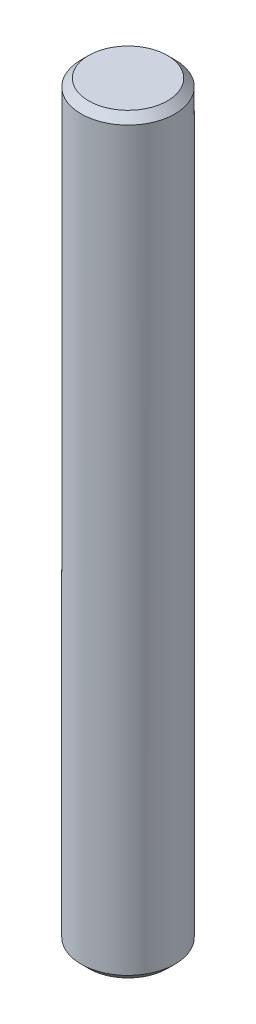
ISO-10303-21;
HEADER;
FILE_DESCRIPTION(('STEP AP214'),'2;1');
FILE_NAME('part.step','',(''),(''),'','','');
FILE_SCHEMA(('AUTOMOTIVE_DESIGN { 1 0 10303 214 1 1 1 1 }'));
ENDSEC;
DATA;
#1=APPLICATION_CONTEXT('core data for automotive mechanical design processes');
#2=APPLICATION_PROTOCOL_DEFINITION('international standard','automotive_design',2000,#1);
#3=PRODUCT_CONTEXT('',#1,'mechanical');
#4=PRODUCT('Part','Part','',(#3));
#5=PRODUCT_RELATED_PRODUCT_CATEGORY('part','',(#4));
#6=PRODUCT_DEFINITION_FORMATION('','',#4);
#7=PRODUCT_DEFINITION_CONTEXT('part definition',#1,'design');
#8=PRODUCT_DEFINITION('design','',#6,#7);
#9=PRODUCT_DEFINITION_SHAPE('','',#8);
#10=(LENGTH_UNIT() NAMED_UNIT(*) SI_UNIT(.MILLI.,.METRE.));
#11=(NAMED_UNIT(*) PLANE_ANGLE_UNIT() SI_UNIT($,.RADIAN.));
#12=(NAMED_UNIT(*) SI_UNIT($,.STERADIAN.) SOLID_ANGLE_UNIT());
#13=UNCERTAINTY_MEASURE_WITH_UNIT(LENGTH_MEASURE(1.E-05),#10,'distance_accuracy_value','');
#14=(GEOMETRIC_REPRESENTATION_CONTEXT(3) GLOBAL_UNCERTAINTY_ASSIGNED_CONTEXT((#13)) GLOBAL_UNIT_ASSIGNED_CONTEXT((#10,
#11,#12)) REPRESENTATION_CONTEXT('',''));
#15=CARTESIAN_POINT('',(0.,0.,0.));
#16=DIRECTION('',(0.,0.,1.));
#17=DIRECTION('',(1.,0.,0.));
#18=AXIS2_PLACEMENT_3D('',#15,#16,#17);
#19=CARTESIAN_POINT('',(0.,50.8,0.));
#20=DIRECTION('',(0.,-1.,0.));
#21=DIRECTION('',(0.,0.,-1.));
#22=AXIS2_PLACEMENT_3D('',#19,#20,#21);
#23=CYLINDRICAL_SURFACE('',#22,3.17119);
#24=CARTESIAN_POINT('',(0.,50.292,0.));
#25=DIRECTION('',(0.,1.,0.));
#26=DIRECTION('',(0.,0.,1.));
#27=AXIS2_PLACEMENT_3D('',#24,#25,#26);
#28=CIRCLE('',#27,3.17119);
#29=CARTESIAN_POINT('',(0.,50.292,3.17119));
#30=VERTEX_POINT('',#29);
#31=EDGE_CURVE('E51',#30,#30,#28,.F.);
#32=ORIENTED_EDGE('',*,*,#31,.T.);
#33=EDGE_LOOP('',(#32));
#34=FACE_BOUND('',#33,.T.);
#35=CARTESIAN_POINT('',(0.,0.508000000000008,0.));
#36=DIRECTION('',(0.,-1.,0.));
#37=DIRECTION('',(0.,0.,-1.));
#38=AXIS2_PLACEMENT_3D('',#35,#36,#37);
#39=CIRCLE('',#38,3.17119);
#40=CARTESIAN_POINT('',(0.,0.508000000000008,-3.17119));
#41=VERTEX_POINT('',#40);
#42=EDGE_CURVE('E57',#41,#41,#39,.F.);
#43=ORIENTED_EDGE('',*,*,#42,.T.);
#44=EDGE_LOOP('',(#43));
#45=FACE_BOUND('',#44,.T.);
#46=ADVANCED_FACE('F42',(#34,#45),#23,.T.);
#47=CARTESIAN_POINT('',(3.17119,50.8,0.));
#48=DIRECTION('',(0.,1.,0.));
#49=DIRECTION('',(0.,0.,1.));
#50=AXIS2_PLACEMENT_3D('',#47,#48,#49);
#51=PLANE('',#50);
#52=CARTESIAN_POINT('',(0.,50.8,0.));
#53=DIRECTION('',(0.,1.,0.));
#54=DIRECTION('',(0.,0.,1.));
#55=AXIS2_PLACEMENT_3D('',#52,#53,#54);
#56=CIRCLE('',#55,2.66319000000001);
#57=CARTESIAN_POINT('',(0.,50.8,2.66319000000001));
#58=VERTEX_POINT('',#57);
#59=EDGE_CURVE('E10',#58,#58,#56,.T.);
#60=ORIENTED_EDGE('',*,*,#59,.T.);
#61=EDGE_LOOP('',(#60));
#62=FACE_BOUND('',#61,.T.);
#63=ADVANCED_FACE('F79',(#62),#51,.T.);
#64=CARTESIAN_POINT('',(0.,0.,0.));
#65=DIRECTION('',(0.,-1.,0.));
#66=DIRECTION('',(0.,0.,-1.));
#67=AXIS2_PLACEMENT_3D('',#64,#65,#66);
#68=PLANE('',#67);
#69=CARTESIAN_POINT('',(0.,0.,0.));
#70=DIRECTION('',(0.,-1.,0.));
#71=DIRECTION('',(0.,0.,-1.));
#72=AXIS2_PLACEMENT_3D('',#69,#70,#71);
#73=CIRCLE('',#72,2.66319000000001);
#74=CARTESIAN_POINT('',(0.,0.,-2.66319000000001));
#75=VERTEX_POINT('',#74);
#76=EDGE_CURVE('E62',#75,#75,#73,.T.);
#77=ORIENTED_EDGE('',*,*,#76,.T.);
#78=EDGE_LOOP('',(#77));
#79=FACE_BOUND('',#78,.T.);
#80=ADVANCED_FACE('F68',(#79),#68,.T.);
#81=CARTESIAN_POINT('',(0.,0.,0.));
#82=DIRECTION('',(0.,1.,0.));
#83=DIRECTION('',(0.,0.,1.));
#84=AXIS2_PLACEMENT_3D('',#81,#82,#83);
#85=CONICAL_SURFACE('',#84,2.66319000000001,0.78539816339743);
#86=ORIENTED_EDGE('',*,*,#42,.F.);
#87=EDGE_LOOP('',(#86));
#88=FACE_BOUND('',#87,.T.);
#89=ORIENTED_EDGE('',*,*,#76,.F.);
#90=EDGE_LOOP('',(#89));
#91=FACE_BOUND('',#90,.T.);
#92=ADVANCED_FACE('F70',(#88,#91),#85,.T.);
#93=CARTESIAN_POINT('',(0.,50.292,0.));
#94=DIRECTION('',(0.,-1.,0.));
#95=DIRECTION('',(0.,0.,-1.));
#96=AXIS2_PLACEMENT_3D('',#93,#94,#95);
#97=CONICAL_SURFACE('',#96,3.17119,0.785398163397444);
#98=ORIENTED_EDGE('',*,*,#59,.F.);
#99=EDGE_LOOP('',(#98));
#100=FACE_BOUND('',#99,.T.);
#101=ORIENTED_EDGE('',*,*,#31,.F.);
#102=EDGE_LOOP('',(#101));
#103=FACE_BOUND('',#102,.T.);
#104=ADVANCED_FACE('F45',(#100,#103),#97,.T.);
#105=CLOSED_SHELL('',(#46,#63,#80,#92,#104));
#106=MANIFOLD_SOLID_BREP('B2',#105);
#107=ADVANCED_BREP_SHAPE_REPRESENTATION('',(#18,#106),#14);
#108=SHAPE_DEFINITION_REPRESENTATION(#9,#107);
ENDSEC;
END-ISO-10303-21;
